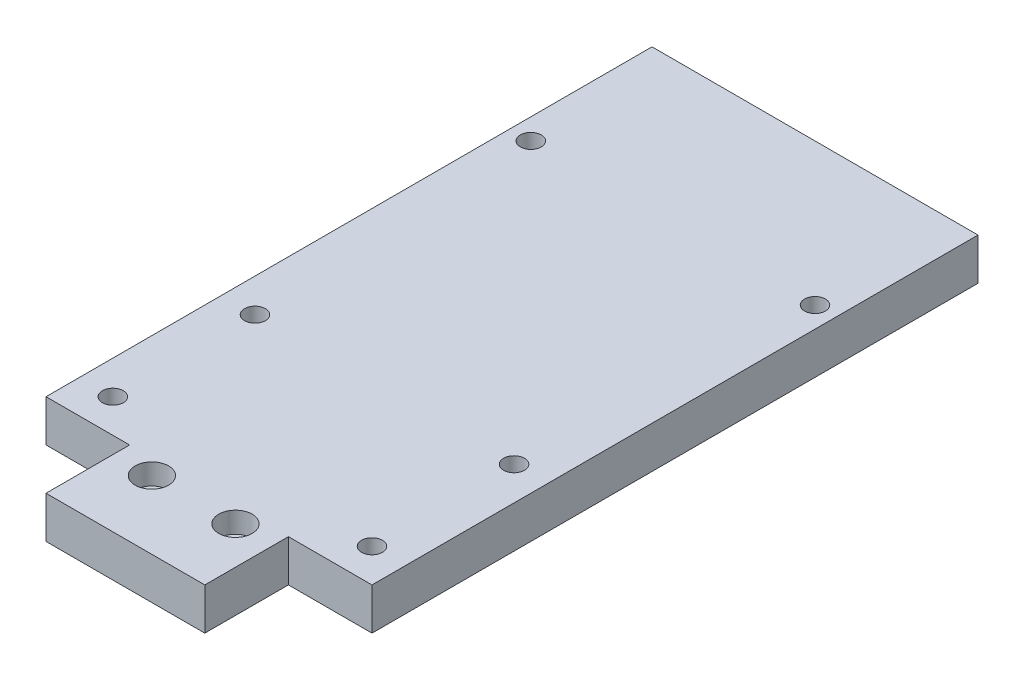
ISO-10303-21;
HEADER;
FILE_DESCRIPTION(('STEP AP214'),'2;1');
FILE_NAME('part.step','',(''),(''),'','','');
FILE_SCHEMA(('AUTOMOTIVE_DESIGN { 1 0 10303 214 1 1 1 1 }'));
ENDSEC;
DATA;
#1=APPLICATION_CONTEXT('core data for automotive mechanical design processes');
#2=APPLICATION_PROTOCOL_DEFINITION('international standard','automotive_design',2000,#1);
#3=PRODUCT_CONTEXT('',#1,'mechanical');
#4=PRODUCT('Part','Part','',(#3));
#5=PRODUCT_RELATED_PRODUCT_CATEGORY('part','',(#4));
#6=PRODUCT_DEFINITION_FORMATION('','',#4);
#7=PRODUCT_DEFINITION_CONTEXT('part definition',#1,'design');
#8=PRODUCT_DEFINITION('design','',#6,#7);
#9=PRODUCT_DEFINITION_SHAPE('','',#8);
#10=(LENGTH_UNIT() NAMED_UNIT(*) SI_UNIT(.MILLI.,.METRE.));
#11=(NAMED_UNIT(*) PLANE_ANGLE_UNIT() SI_UNIT($,.RADIAN.));
#12=(NAMED_UNIT(*) SI_UNIT($,.STERADIAN.) SOLID_ANGLE_UNIT());
#13=UNCERTAINTY_MEASURE_WITH_UNIT(LENGTH_MEASURE(1.E-05),#10,'distance_accuracy_value','');
#14=(GEOMETRIC_REPRESENTATION_CONTEXT(3) GLOBAL_UNCERTAINTY_ASSIGNED_CONTEXT((#13)) GLOBAL_UNIT_ASSIGNED_CONTEXT((#10,
#11,#12)) REPRESENTATION_CONTEXT('',''));
#15=CARTESIAN_POINT('',(0.,0.,0.));
#16=DIRECTION('',(0.,0.,1.));
#17=DIRECTION('',(1.,0.,0.));
#18=AXIS2_PLACEMENT_3D('',#15,#16,#17);
#19=CARTESIAN_POINT('',(0.,10.,-20.));
#20=DIRECTION('',(1.,0.,0.));
#21=DIRECTION('',(0.,0.,-1.));
#22=AXIS2_PLACEMENT_3D('',#19,#20,#21);
#23=PLANE('',#22);
#24=DIRECTION('',(0.,0.,1.));
#25=VECTOR('',#24,1.);
#26=CARTESIAN_POINT('',(0.,0.,-20.));
#27=LINE('',#26,#25);
#28=CARTESIAN_POINT('',(0.,0.,-20.));
#29=VERTEX_POINT('',#28);
#30=CARTESIAN_POINT('',(0.,0.,0.));
#31=VERTEX_POINT('',#30);
#32=EDGE_CURVE('E133',#29,#31,#27,.T.);
#33=ORIENTED_EDGE('',*,*,#32,.T.);
#34=DIRECTION('',(0.,-1.,0.));
#35=VECTOR('',#34,1.);
#36=CARTESIAN_POINT('',(0.,10.,0.));
#37=LINE('',#36,#35);
#38=CARTESIAN_POINT('',(0.,10.,0.));
#39=VERTEX_POINT('',#38);
#40=EDGE_CURVE('E11',#39,#31,#37,.T.);
#41=ORIENTED_EDGE('',*,*,#40,.F.);
#42=DIRECTION('',(0.,0.,1.));
#43=VECTOR('',#42,1.);
#44=CARTESIAN_POINT('',(0.,10.,-20.));
#45=LINE('',#44,#43);
#46=CARTESIAN_POINT('',(0.,10.,-20.));
#47=VERTEX_POINT('',#46);
#48=EDGE_CURVE('E148',#47,#39,#45,.T.);
#49=ORIENTED_EDGE('',*,*,#48,.F.);
#50=DIRECTION('',(0.,-1.,0.));
#51=VECTOR('',#50,1.);
#52=CARTESIAN_POINT('',(0.,10.,-20.));
#53=LINE('',#52,#51);
#54=EDGE_CURVE('E129',#47,#29,#53,.T.);
#55=ORIENTED_EDGE('',*,*,#54,.T.);
#56=EDGE_LOOP('',(#33,#41,#49,#55));
#57=FACE_BOUND('',#56,.T.);
#58=ADVANCED_FACE('F37',(#57),#23,.F.);
#59=CARTESIAN_POINT('',(0.,10.,0.));
#60=DIRECTION('',(0.,0.,-1.));
#61=DIRECTION('',(-1.,0.,0.));
#62=AXIS2_PLACEMENT_3D('',#59,#60,#61);
#63=PLANE('',#62);
#64=DIRECTION('',(1.,0.,0.));
#65=VECTOR('',#64,1.);
#66=CARTESIAN_POINT('',(0.,0.,0.));
#67=LINE('',#66,#65);
#68=CARTESIAN_POINT('',(38.,0.,0.));
#69=VERTEX_POINT('',#68);
#70=EDGE_CURVE('E136',#31,#69,#67,.T.);
#71=ORIENTED_EDGE('',*,*,#70,.T.);
#72=DIRECTION('',(0.,-1.,0.));
#73=VECTOR('',#72,1.);
#74=CARTESIAN_POINT('',(38.,10.,0.));
#75=LINE('',#74,#73);
#76=CARTESIAN_POINT('',(38.,10.,0.));
#77=VERTEX_POINT('',#76);
#78=EDGE_CURVE('E45',#77,#69,#75,.T.);
#79=ORIENTED_EDGE('',*,*,#78,.F.);
#80=DIRECTION('',(1.,0.,0.));
#81=VECTOR('',#80,1.);
#82=CARTESIAN_POINT('',(0.,10.,0.));
#83=LINE('',#82,#81);
#84=EDGE_CURVE('E96',#39,#77,#83,.T.);
#85=ORIENTED_EDGE('',*,*,#84,.F.);
#86=ORIENTED_EDGE('',*,*,#40,.T.);
#87=EDGE_LOOP('',(#71,#79,#85,#86));
#88=FACE_BOUND('',#87,.T.);
#89=ADVANCED_FACE('F334',(#88),#63,.F.);
#90=CARTESIAN_POINT('',(38.,10.,0.));
#91=DIRECTION('',(-1.,0.,0.));
#92=DIRECTION('',(0.,0.,1.));
#93=AXIS2_PLACEMENT_3D('',#90,#91,#92);
#94=PLANE('',#93);
#95=DIRECTION('',(0.,0.,-1.));
#96=VECTOR('',#95,1.);
#97=CARTESIAN_POINT('',(38.,0.,0.));
#98=LINE('',#97,#96);
#99=CARTESIAN_POINT('',(38.,0.,-20.));
#100=VERTEX_POINT('',#99);
#101=EDGE_CURVE('E139',#69,#100,#98,.T.);
#102=ORIENTED_EDGE('',*,*,#101,.T.);
#103=DIRECTION('',(0.,-1.,0.));
#104=VECTOR('',#103,1.);
#105=CARTESIAN_POINT('',(38.,10.,-20.));
#106=LINE('',#105,#104);
#107=CARTESIAN_POINT('',(38.,10.,-20.));
#108=VERTEX_POINT('',#107);
#109=EDGE_CURVE('E155',#108,#100,#106,.T.);
#110=ORIENTED_EDGE('',*,*,#109,.F.);
#111=DIRECTION('',(0.,0.,-1.));
#112=VECTOR('',#111,1.);
#113=CARTESIAN_POINT('',(38.,10.,0.));
#114=LINE('',#113,#112);
#115=EDGE_CURVE('E163',#77,#108,#114,.T.);
#116=ORIENTED_EDGE('',*,*,#115,.F.);
#117=ORIENTED_EDGE('',*,*,#78,.T.);
#118=EDGE_LOOP('',(#102,#110,#116,#117));
#119=FACE_BOUND('',#118,.T.);
#120=ADVANCED_FACE('F161',(#119),#94,.F.);
#121=CARTESIAN_POINT('',(38.,10.,-20.));
#122=DIRECTION('',(0.,0.,-1.));
#123=DIRECTION('',(-1.,0.,0.));
#124=AXIS2_PLACEMENT_3D('',#121,#122,#123);
#125=PLANE('',#124);
#126=DIRECTION('',(1.,0.,0.));
#127=VECTOR('',#126,1.);
#128=CARTESIAN_POINT('',(38.,0.,-20.));
#129=LINE('',#128,#127);
#130=CARTESIAN_POINT('',(58.,0.,-20.));
#131=VERTEX_POINT('',#130);
#132=EDGE_CURVE('E141',#100,#131,#129,.T.);
#133=ORIENTED_EDGE('',*,*,#132,.T.);
#134=DIRECTION('',(0.,-1.,0.));
#135=VECTOR('',#134,1.);
#136=CARTESIAN_POINT('',(58.,10.,-20.));
#137=LINE('',#136,#135);
#138=CARTESIAN_POINT('',(58.,10.,-20.));
#139=VERTEX_POINT('',#138);
#140=EDGE_CURVE('E152',#139,#131,#137,.T.);
#141=ORIENTED_EDGE('',*,*,#140,.F.);
#142=DIRECTION('',(1.,0.,0.));
#143=VECTOR('',#142,1.);
#144=CARTESIAN_POINT('',(38.,10.,-20.));
#145=LINE('',#144,#143);
#146=EDGE_CURVE('E175',#108,#139,#145,.T.);
#147=ORIENTED_EDGE('',*,*,#146,.F.);
#148=ORIENTED_EDGE('',*,*,#109,.T.);
#149=EDGE_LOOP('',(#133,#141,#147,#148));
#150=FACE_BOUND('',#149,.T.);
#151=ADVANCED_FACE('F171',(#150),#125,.F.);
#152=CARTESIAN_POINT('',(58.,10.,-20.));
#153=DIRECTION('',(-1.,0.,0.));
#154=DIRECTION('',(0.,0.,1.));
#155=AXIS2_PLACEMENT_3D('',#152,#153,#154);
#156=PLANE('',#155);
#157=DIRECTION('',(0.,0.,-1.));
#158=VECTOR('',#157,1.);
#159=CARTESIAN_POINT('',(58.,0.,-20.));
#160=LINE('',#159,#158);
#161=CARTESIAN_POINT('',(58.,0.,-165.));
#162=VERTEX_POINT('',#161);
#163=EDGE_CURVE('E143',#131,#162,#160,.T.);
#164=ORIENTED_EDGE('',*,*,#163,.T.);
#165=DIRECTION('',(0.,-1.,0.));
#166=VECTOR('',#165,1.);
#167=CARTESIAN_POINT('',(58.,10.,-165.));
#168=LINE('',#167,#166);
#169=CARTESIAN_POINT('',(58.,10.,-165.));
#170=VERTEX_POINT('',#169);
#171=EDGE_CURVE('E124',#170,#162,#168,.T.);
#172=ORIENTED_EDGE('',*,*,#171,.F.);
#173=DIRECTION('',(0.,0.,-1.));
#174=VECTOR('',#173,1.);
#175=CARTESIAN_POINT('',(58.,10.,-20.));
#176=LINE('',#175,#174);
#177=EDGE_CURVE('E115',#139,#170,#176,.T.);
#178=ORIENTED_EDGE('',*,*,#177,.F.);
#179=ORIENTED_EDGE('',*,*,#140,.T.);
#180=EDGE_LOOP('',(#164,#172,#178,#179));
#181=FACE_BOUND('',#180,.T.);
#182=ADVANCED_FACE('F174',(#181),#156,.F.);
#183=CARTESIAN_POINT('',(58.,10.,-165.));
#184=DIRECTION('',(0.,0.,1.));
#185=DIRECTION('',(1.,0.,0.));
#186=AXIS2_PLACEMENT_3D('',#183,#184,#185);
#187=PLANE('',#186);
#188=DIRECTION('',(-1.,0.,0.));
#189=VECTOR('',#188,1.);
#190=CARTESIAN_POINT('',(58.,0.,-165.));
#191=LINE('',#190,#189);
#192=CARTESIAN_POINT('',(-20.,0.,-165.));
#193=VERTEX_POINT('',#192);
#194=EDGE_CURVE('E123',#162,#193,#191,.T.);
#195=ORIENTED_EDGE('',*,*,#194,.T.);
#196=DIRECTION('',(0.,-1.,0.));
#197=VECTOR('',#196,1.);
#198=CARTESIAN_POINT('',(-20.,10.,-165.));
#199=LINE('',#198,#197);
#200=CARTESIAN_POINT('',(-20.,10.,-165.));
#201=VERTEX_POINT('',#200);
#202=EDGE_CURVE('E120',#201,#193,#199,.T.);
#203=ORIENTED_EDGE('',*,*,#202,.F.);
#204=DIRECTION('',(-1.,0.,0.));
#205=VECTOR('',#204,1.);
#206=CARTESIAN_POINT('',(58.,10.,-165.));
#207=LINE('',#206,#205);
#208=EDGE_CURVE('E109',#170,#201,#207,.T.);
#209=ORIENTED_EDGE('',*,*,#208,.F.);
#210=ORIENTED_EDGE('',*,*,#171,.T.);
#211=EDGE_LOOP('',(#195,#203,#209,#210));
#212=FACE_BOUND('',#211,.T.);
#213=ADVANCED_FACE('F121',(#212),#187,.F.);
#214=CARTESIAN_POINT('',(-20.,10.,-165.));
#215=DIRECTION('',(1.,0.,0.));
#216=DIRECTION('',(0.,0.,-1.));
#217=AXIS2_PLACEMENT_3D('',#214,#215,#216);
#218=PLANE('',#217);
#219=DIRECTION('',(0.,0.,1.));
#220=VECTOR('',#219,1.);
#221=CARTESIAN_POINT('',(-20.,0.,-165.));
#222=LINE('',#221,#220);
#223=CARTESIAN_POINT('',(-20.,0.,-20.));
#224=VERTEX_POINT('',#223);
#225=EDGE_CURVE('E82',#193,#224,#222,.T.);
#226=ORIENTED_EDGE('',*,*,#225,.T.);
#227=DIRECTION('',(0.,-1.,0.));
#228=VECTOR('',#227,1.);
#229=CARTESIAN_POINT('',(-20.,10.,-20.));
#230=LINE('',#229,#228);
#231=CARTESIAN_POINT('',(-20.,10.,-20.));
#232=VERTEX_POINT('',#231);
#233=EDGE_CURVE('E125',#232,#224,#230,.T.);
#234=ORIENTED_EDGE('',*,*,#233,.F.);
#235=DIRECTION('',(0.,0.,1.));
#236=VECTOR('',#235,1.);
#237=CARTESIAN_POINT('',(-20.,10.,-165.));
#238=LINE('',#237,#236);
#239=EDGE_CURVE('E113',#201,#232,#238,.T.);
#240=ORIENTED_EDGE('',*,*,#239,.F.);
#241=ORIENTED_EDGE('',*,*,#202,.T.);
#242=EDGE_LOOP('',(#226,#234,#240,#241));
#243=FACE_BOUND('',#242,.T.);
#244=ADVANCED_FACE('F127',(#243),#218,.F.);
#245=CARTESIAN_POINT('',(-20.,10.,-20.));
#246=DIRECTION('',(0.,0.,-1.));
#247=DIRECTION('',(-1.,0.,0.));
#248=AXIS2_PLACEMENT_3D('',#245,#246,#247);
#249=PLANE('',#248);
#250=DIRECTION('',(1.,0.,0.));
#251=VECTOR('',#250,1.);
#252=CARTESIAN_POINT('',(-20.,0.,-20.));
#253=LINE('',#252,#251);
#254=EDGE_CURVE('E88',#224,#29,#253,.T.);
#255=ORIENTED_EDGE('',*,*,#254,.T.);
#256=ORIENTED_EDGE('',*,*,#54,.F.);
#257=DIRECTION('',(1.,0.,0.));
#258=VECTOR('',#257,1.);
#259=CARTESIAN_POINT('',(-20.,10.,-20.));
#260=LINE('',#259,#258);
#261=EDGE_CURVE('E53',#232,#47,#260,.T.);
#262=ORIENTED_EDGE('',*,*,#261,.F.);
#263=ORIENTED_EDGE('',*,*,#233,.T.);
#264=EDGE_LOOP('',(#255,#256,#262,#263));
#265=FACE_BOUND('',#264,.T.);
#266=ADVANCED_FACE('F325',(#265),#249,.F.);
#267=CARTESIAN_POINT('',(0.,10.,0.));
#268=DIRECTION('',(0.,1.,0.));
#269=DIRECTION('',(0.,0.,1.));
#270=AXIS2_PLACEMENT_3D('',#267,#268,#269);
#271=PLANE('',#270);
#272=CARTESIAN_POINT('',(-12.,10.,-62.));
#273=DIRECTION('',(0.,-1.,0.));
#274=DIRECTION('',(0.,0.,-1.));
#275=AXIS2_PLACEMENT_3D('',#272,#273,#274);
#276=CIRCLE('',#275,2.5);
#277=CARTESIAN_POINT('',(-12.,10.,-64.5));
#278=VERTEX_POINT('',#277);
#279=EDGE_CURVE('E259',#278,#278,#276,.T.);
#280=ORIENTED_EDGE('',*,*,#279,.T.);
#281=EDGE_LOOP('',(#280));
#282=FACE_BOUND('',#281,.T.);
#283=CARTESIAN_POINT('',(50.,10.,-28.));
#284=DIRECTION('',(0.,-1.,0.));
#285=DIRECTION('',(0.,0.,-1.));
#286=AXIS2_PLACEMENT_3D('',#283,#284,#285);
#287=CIRCLE('',#286,2.5);
#288=CARTESIAN_POINT('',(50.,10.,-30.5));
#289=VERTEX_POINT('',#288);
#290=EDGE_CURVE('E266',#289,#289,#287,.T.);
#291=ORIENTED_EDGE('',*,*,#290,.T.);
#292=EDGE_LOOP('',(#291));
#293=FACE_BOUND('',#292,.T.);
#294=CARTESIAN_POINT('',(-12.,10.,-28.));
#295=DIRECTION('',(0.,-1.,0.));
#296=DIRECTION('',(0.,0.,-1.));
#297=AXIS2_PLACEMENT_3D('',#294,#295,#296);
#298=CIRCLE('',#297,2.5);
#299=CARTESIAN_POINT('',(-12.,10.,-30.5));
#300=VERTEX_POINT('',#299);
#301=EDGE_CURVE('E247',#300,#300,#298,.T.);
#302=ORIENTED_EDGE('',*,*,#301,.T.);
#303=EDGE_LOOP('',(#302));
#304=FACE_BOUND('',#303,.T.);
#305=CARTESIAN_POINT('',(53.,10.,-131.));
#306=DIRECTION('',(0.,-1.,0.));
#307=DIRECTION('',(0.,0.,-1.));
#308=AXIS2_PLACEMENT_3D('',#305,#306,#307);
#309=CIRCLE('',#308,2.5);
#310=CARTESIAN_POINT('',(53.,10.,-133.5));
#311=VERTEX_POINT('',#310);
#312=EDGE_CURVE('E254',#311,#311,#309,.T.);
#313=ORIENTED_EDGE('',*,*,#312,.T.);
#314=EDGE_LOOP('',(#313));
#315=FACE_BOUND('',#314,.T.);
#316=CARTESIAN_POINT('',(50.,10.,-62.));
#317=DIRECTION('',(0.,-1.,0.));
#318=DIRECTION('',(0.,0.,-1.));
#319=AXIS2_PLACEMENT_3D('',#316,#317,#318);
#320=CIRCLE('',#319,2.5);
#321=CARTESIAN_POINT('',(50.,10.,-64.5));
#322=VERTEX_POINT('',#321);
#323=EDGE_CURVE('E271',#322,#322,#320,.T.);
#324=ORIENTED_EDGE('',*,*,#323,.T.);
#325=EDGE_LOOP('',(#324));
#326=FACE_BOUND('',#325,.T.);
#327=CARTESIAN_POINT('',(-15.,10.,-131.));
#328=DIRECTION('',(0.,-1.,0.));
#329=DIRECTION('',(0.,0.,-1.));
#330=AXIS2_PLACEMENT_3D('',#327,#328,#329);
#331=CIRCLE('',#330,2.5);
#332=CARTESIAN_POINT('',(-15.,10.,-133.5));
#333=VERTEX_POINT('',#332);
#334=EDGE_CURVE('E238',#333,#333,#331,.T.);
#335=ORIENTED_EDGE('',*,*,#334,.T.);
#336=EDGE_LOOP('',(#335));
#337=FACE_BOUND('',#336,.T.);
#338=CARTESIAN_POINT('',(9.,10.,-16.3298675950837));
#339=DIRECTION('',(0.,1.,0.));
#340=DIRECTION('',(0.,0.,1.));
#341=AXIS2_PLACEMENT_3D('',#338,#339,#340);
#342=CIRCLE('',#341,4.);
#343=CARTESIAN_POINT('',(9.,10.,-12.3298675950837));
#344=VERTEX_POINT('',#343);
#345=EDGE_CURVE('E188',#344,#344,#342,.T.);
#346=ORIENTED_EDGE('',*,*,#345,.F.);
#347=EDGE_LOOP('',(#346));
#348=FACE_BOUND('',#347,.T.);
#349=CARTESIAN_POINT('',(29.,10.,-16.3298675950837));
#350=DIRECTION('',(0.,1.,0.));
#351=DIRECTION('',(0.,0.,1.));
#352=AXIS2_PLACEMENT_3D('',#349,#350,#351);
#353=CIRCLE('',#352,4.00000000000001);
#354=CARTESIAN_POINT('',(29.,10.,-12.3298675950837));
#355=VERTEX_POINT('',#354);
#356=EDGE_CURVE('E184',#355,#355,#353,.T.);
#357=ORIENTED_EDGE('',*,*,#356,.F.);
#358=EDGE_LOOP('',(#357));
#359=FACE_BOUND('',#358,.T.);
#360=ORIENTED_EDGE('',*,*,#48,.T.);
#361=ORIENTED_EDGE('',*,*,#84,.T.);
#362=ORIENTED_EDGE('',*,*,#115,.T.);
#363=ORIENTED_EDGE('',*,*,#146,.T.);
#364=ORIENTED_EDGE('',*,*,#177,.T.);
#365=ORIENTED_EDGE('',*,*,#208,.T.);
#366=ORIENTED_EDGE('',*,*,#239,.T.);
#367=ORIENTED_EDGE('',*,*,#261,.T.);
#368=EDGE_LOOP('',(#360,#361,#362,#363,#364,#365,#366,#367));
#369=FACE_BOUND('',#368,.T.);
#370=ADVANCED_FACE('F111',(#282,#293,#304,#315,#326,#337,#348,#359,#369),#271,.T.);
#371=CARTESIAN_POINT('',(0.,0.,0.));
#372=DIRECTION('',(0.,1.,0.));
#373=DIRECTION('',(0.,0.,1.));
#374=AXIS2_PLACEMENT_3D('',#371,#372,#373);
#375=PLANE('',#374);
#376=CARTESIAN_POINT('',(-12.,0.,-62.));
#377=DIRECTION('',(0.,-1.,0.));
#378=DIRECTION('',(0.,0.,-1.));
#379=AXIS2_PLACEMENT_3D('',#376,#377,#378);
#380=CIRCLE('',#379,4.);
#381=CARTESIAN_POINT('',(-12.,0.,-66.));
#382=VERTEX_POINT('',#381);
#383=EDGE_CURVE('E226',#382,#382,#380,.T.);
#384=ORIENTED_EDGE('',*,*,#383,.F.);
#385=EDGE_LOOP('',(#384));
#386=FACE_BOUND('',#385,.T.);
#387=CARTESIAN_POINT('',(50.,0.,-28.));
#388=DIRECTION('',(0.,-1.,0.));
#389=DIRECTION('',(0.,0.,-1.));
#390=AXIS2_PLACEMENT_3D('',#387,#388,#389);
#391=CIRCLE('',#390,4.00000000000001);
#392=CARTESIAN_POINT('',(50.,0.,-32.));
#393=VERTEX_POINT('',#392);
#394=EDGE_CURVE('E215',#393,#393,#391,.T.);
#395=ORIENTED_EDGE('',*,*,#394,.F.);
#396=EDGE_LOOP('',(#395));
#397=FACE_BOUND('',#396,.T.);
#398=CARTESIAN_POINT('',(-12.,0.,-28.));
#399=DIRECTION('',(0.,-1.,0.));
#400=DIRECTION('',(0.,0.,-1.));
#401=AXIS2_PLACEMENT_3D('',#398,#399,#400);
#402=CIRCLE('',#401,4.);
#403=CARTESIAN_POINT('',(-12.,0.,-32.));
#404=VERTEX_POINT('',#403);
#405=EDGE_CURVE('E214',#404,#404,#402,.T.);
#406=ORIENTED_EDGE('',*,*,#405,.F.);
#407=EDGE_LOOP('',(#406));
#408=FACE_BOUND('',#407,.T.);
#409=CARTESIAN_POINT('',(53.,0.,-131.));
#410=DIRECTION('',(0.,-1.,0.));
#411=DIRECTION('',(0.,0.,-1.));
#412=AXIS2_PLACEMENT_3D('',#409,#410,#411);
#413=CIRCLE('',#412,4.00000000000001);
#414=CARTESIAN_POINT('',(53.,0.,-135.));
#415=VERTEX_POINT('',#414);
#416=EDGE_CURVE('E208',#415,#415,#413,.T.);
#417=ORIENTED_EDGE('',*,*,#416,.F.);
#418=EDGE_LOOP('',(#417));
#419=FACE_BOUND('',#418,.T.);
#420=CARTESIAN_POINT('',(50.,0.,-62.));
#421=DIRECTION('',(0.,-1.,0.));
#422=DIRECTION('',(0.,0.,-1.));
#423=AXIS2_PLACEMENT_3D('',#420,#421,#422);
#424=CIRCLE('',#423,4.00000000000001);
#425=CARTESIAN_POINT('',(50.,0.,-66.));
#426=VERTEX_POINT('',#425);
#427=EDGE_CURVE('E227',#426,#426,#424,.T.);
#428=ORIENTED_EDGE('',*,*,#427,.F.);
#429=EDGE_LOOP('',(#428));
#430=FACE_BOUND('',#429,.T.);
#431=CARTESIAN_POINT('',(-15.,0.,-131.));
#432=DIRECTION('',(0.,-1.,0.));
#433=DIRECTION('',(0.,0.,-1.));
#434=AXIS2_PLACEMENT_3D('',#431,#432,#433);
#435=CIRCLE('',#434,4.);
#436=CARTESIAN_POINT('',(-15.,0.,-135.));
#437=VERTEX_POINT('',#436);
#438=EDGE_CURVE('E205',#437,#437,#435,.T.);
#439=ORIENTED_EDGE('',*,*,#438,.F.);
#440=EDGE_LOOP('',(#439));
#441=FACE_BOUND('',#440,.T.);
#442=CARTESIAN_POINT('',(9.,0.,-16.3298675950837));
#443=DIRECTION('',(0.,1.,0.));
#444=DIRECTION('',(0.,0.,1.));
#445=AXIS2_PLACEMENT_3D('',#442,#443,#444);
#446=CIRCLE('',#445,2.5);
#447=CARTESIAN_POINT('',(9.,0.,-13.8298675950837));
#448=VERTEX_POINT('',#447);
#449=EDGE_CURVE('E185',#448,#448,#446,.T.);
#450=ORIENTED_EDGE('',*,*,#449,.T.);
#451=EDGE_LOOP('',(#450));
#452=FACE_BOUND('',#451,.T.);
#453=CARTESIAN_POINT('',(29.,0.,-16.3298675950837));
#454=DIRECTION('',(0.,1.,0.));
#455=DIRECTION('',(0.,0.,1.));
#456=AXIS2_PLACEMENT_3D('',#453,#454,#455);
#457=CIRCLE('',#456,2.5);
#458=CARTESIAN_POINT('',(29.,0.,-13.8298675950837));
#459=VERTEX_POINT('',#458);
#460=EDGE_CURVE('E193',#459,#459,#457,.T.);
#461=ORIENTED_EDGE('',*,*,#460,.T.);
#462=EDGE_LOOP('',(#461));
#463=FACE_BOUND('',#462,.T.);
#464=ORIENTED_EDGE('',*,*,#32,.F.);
#465=ORIENTED_EDGE('',*,*,#254,.F.);
#466=ORIENTED_EDGE('',*,*,#225,.F.);
#467=ORIENTED_EDGE('',*,*,#194,.F.);
#468=ORIENTED_EDGE('',*,*,#163,.F.);
#469=ORIENTED_EDGE('',*,*,#132,.F.);
#470=ORIENTED_EDGE('',*,*,#101,.F.);
#471=ORIENTED_EDGE('',*,*,#70,.F.);
#472=EDGE_LOOP('',(#464,#465,#466,#467,#468,#469,#470,#471));
#473=FACE_BOUND('',#472,.T.);
#474=ADVANCED_FACE('F167',(#386,#397,#408,#419,#430,#441,#452,#463,#473),#375,.F.);
#475=CARTESIAN_POINT('',(29.,5.,-16.3298675950837));
#476=DIRECTION('',(0.,1.,0.));
#477=DIRECTION('',(0.,0.,1.));
#478=AXIS2_PLACEMENT_3D('',#475,#476,#477);
#479=CYLINDRICAL_SURFACE('',#478,4.00000000000001);
#480=CARTESIAN_POINT('',(29.,5.,-16.3298675950837));
#481=DIRECTION('',(0.,1.,0.));
#482=DIRECTION('',(0.,0.,1.));
#483=AXIS2_PLACEMENT_3D('',#480,#481,#482);
#484=CIRCLE('',#483,4.00000000000001);
#485=CARTESIAN_POINT('',(29.,5.,-12.3298675950837));
#486=VERTEX_POINT('',#485);
#487=EDGE_CURVE('E181',#486,#486,#484,.T.);
#488=ORIENTED_EDGE('',*,*,#487,.F.);
#489=EDGE_LOOP('',(#488));
#490=FACE_BOUND('',#489,.T.);
#491=ORIENTED_EDGE('',*,*,#356,.T.);
#492=EDGE_LOOP('',(#491));
#493=FACE_BOUND('',#492,.T.);
#494=ADVANCED_FACE('F295',(#490,#493),#479,.F.);
#495=CARTESIAN_POINT('',(29.,5.,-16.3298675950837));
#496=DIRECTION('',(0.,1.,0.));
#497=DIRECTION('',(0.,0.,1.));
#498=AXIS2_PLACEMENT_3D('',#495,#496,#497);
#499=PLANE('',#498);
#500=CARTESIAN_POINT('',(29.,5.,-16.3298675950837));
#501=DIRECTION('',(0.,1.,0.));
#502=DIRECTION('',(0.,0.,1.));
#503=AXIS2_PLACEMENT_3D('',#500,#501,#502);
#504=CIRCLE('',#503,2.5);
#505=CARTESIAN_POINT('',(29.,5.,-13.8298675950837));
#506=VERTEX_POINT('',#505);
#507=EDGE_CURVE('E196',#506,#506,#504,.T.);
#508=ORIENTED_EDGE('',*,*,#507,.F.);
#509=EDGE_LOOP('',(#508));
#510=FACE_BOUND('',#509,.T.);
#511=ORIENTED_EDGE('',*,*,#487,.T.);
#512=EDGE_LOOP('',(#511));
#513=FACE_BOUND('',#512,.T.);
#514=ADVANCED_FACE('F312',(#510,#513),#499,.T.);
#515=CARTESIAN_POINT('',(9.,5.,-16.3298675950837));
#516=DIRECTION('',(0.,1.,0.));
#517=DIRECTION('',(0.,0.,1.));
#518=AXIS2_PLACEMENT_3D('',#515,#516,#517);
#519=CYLINDRICAL_SURFACE('',#518,4.);
#520=CARTESIAN_POINT('',(9.,5.,-16.3298675950837));
#521=DIRECTION('',(0.,1.,0.));
#522=DIRECTION('',(0.,0.,1.));
#523=AXIS2_PLACEMENT_3D('',#520,#521,#522);
#524=CIRCLE('',#523,4.);
#525=CARTESIAN_POINT('',(9.,5.,-12.3298675950837));
#526=VERTEX_POINT('',#525);
#527=EDGE_CURVE('E137',#526,#526,#524,.T.);
#528=ORIENTED_EDGE('',*,*,#527,.F.);
#529=EDGE_LOOP('',(#528));
#530=FACE_BOUND('',#529,.T.);
#531=ORIENTED_EDGE('',*,*,#345,.T.);
#532=EDGE_LOOP('',(#531));
#533=FACE_BOUND('',#532,.T.);
#534=ADVANCED_FACE('F315',(#530,#533),#519,.F.);
#535=CARTESIAN_POINT('',(9.,5.,-16.3298675950837));
#536=DIRECTION('',(0.,1.,0.));
#537=DIRECTION('',(0.,0.,1.));
#538=AXIS2_PLACEMENT_3D('',#535,#536,#537);
#539=PLANE('',#538);
#540=CARTESIAN_POINT('',(9.,5.,-16.3298675950837));
#541=DIRECTION('',(0.,1.,0.));
#542=DIRECTION('',(0.,0.,1.));
#543=AXIS2_PLACEMENT_3D('',#540,#541,#542);
#544=CIRCLE('',#543,2.5);
#545=CARTESIAN_POINT('',(9.,5.,-13.8298675950837));
#546=VERTEX_POINT('',#545);
#547=EDGE_CURVE('E200',#546,#546,#544,.T.);
#548=ORIENTED_EDGE('',*,*,#547,.F.);
#549=EDGE_LOOP('',(#548));
#550=FACE_BOUND('',#549,.T.);
#551=ORIENTED_EDGE('',*,*,#527,.T.);
#552=EDGE_LOOP('',(#551));
#553=FACE_BOUND('',#552,.T.);
#554=ADVANCED_FACE('F308',(#550,#553),#539,.T.);
#555=CARTESIAN_POINT('',(29.,0.,-16.3298675950837));
#556=DIRECTION('',(0.,1.,0.));
#557=DIRECTION('',(0.,0.,1.));
#558=AXIS2_PLACEMENT_3D('',#555,#556,#557);
#559=CYLINDRICAL_SURFACE('',#558,2.5);
#560=ORIENTED_EDGE('',*,*,#460,.F.);
#561=EDGE_LOOP('',(#560));
#562=FACE_BOUND('',#561,.T.);
#563=ORIENTED_EDGE('',*,*,#507,.T.);
#564=EDGE_LOOP('',(#563));
#565=FACE_BOUND('',#564,.T.);
#566=ADVANCED_FACE('F304',(#562,#565),#559,.F.);
#567=CARTESIAN_POINT('',(9.,0.,-16.3298675950837));
#568=DIRECTION('',(0.,1.,0.));
#569=DIRECTION('',(0.,0.,1.));
#570=AXIS2_PLACEMENT_3D('',#567,#568,#569);
#571=CYLINDRICAL_SURFACE('',#570,2.5);
#572=ORIENTED_EDGE('',*,*,#449,.F.);
#573=EDGE_LOOP('',(#572));
#574=FACE_BOUND('',#573,.T.);
#575=ORIENTED_EDGE('',*,*,#547,.T.);
#576=EDGE_LOOP('',(#575));
#577=FACE_BOUND('',#576,.T.);
#578=ADVANCED_FACE('F307',(#574,#577),#571,.F.);
#579=CARTESIAN_POINT('',(-15.,5.,-131.));
#580=DIRECTION('',(0.,-1.,0.));
#581=DIRECTION('',(0.,0.,-1.));
#582=AXIS2_PLACEMENT_3D('',#579,#580,#581);
#583=CYLINDRICAL_SURFACE('',#582,4.);
#584=CARTESIAN_POINT('',(-15.,5.,-131.));
#585=DIRECTION('',(0.,-1.,0.));
#586=DIRECTION('',(0.,0.,-1.));
#587=AXIS2_PLACEMENT_3D('',#584,#585,#586);
#588=CIRCLE('',#587,4.);
#589=CARTESIAN_POINT('',(-15.,5.,-135.));
#590=VERTEX_POINT('',#589);
#591=EDGE_CURVE('E197',#590,#590,#588,.T.);
#592=ORIENTED_EDGE('',*,*,#591,.F.);
#593=EDGE_LOOP('',(#592));
#594=FACE_BOUND('',#593,.T.);
#595=ORIENTED_EDGE('',*,*,#438,.T.);
#596=EDGE_LOOP('',(#595));
#597=FACE_BOUND('',#596,.T.);
#598=ADVANCED_FACE('F414',(#594,#597),#583,.F.);
#599=CARTESIAN_POINT('',(-15.,5.,-131.));
#600=DIRECTION('',(0.,-1.,0.));
#601=DIRECTION('',(0.,0.,-1.));
#602=AXIS2_PLACEMENT_3D('',#599,#600,#601);
#603=PLANE('',#602);
#604=CARTESIAN_POINT('',(-15.,5.,-131.));
#605=DIRECTION('',(0.,-1.,0.));
#606=DIRECTION('',(0.,0.,-1.));
#607=AXIS2_PLACEMENT_3D('',#604,#605,#606);
#608=CIRCLE('',#607,2.5);
#609=CARTESIAN_POINT('',(-15.,5.,-133.5));
#610=VERTEX_POINT('',#609);
#611=EDGE_CURVE('E241',#610,#610,#608,.T.);
#612=ORIENTED_EDGE('',*,*,#611,.F.);
#613=EDGE_LOOP('',(#612));
#614=FACE_BOUND('',#613,.T.);
#615=ORIENTED_EDGE('',*,*,#591,.T.);
#616=EDGE_LOOP('',(#615));
#617=FACE_BOUND('',#616,.T.);
#618=ADVANCED_FACE('F289',(#614,#617),#603,.T.);
#619=CARTESIAN_POINT('',(50.,5.,-62.));
#620=DIRECTION('',(0.,-1.,0.));
#621=DIRECTION('',(0.,0.,-1.));
#622=AXIS2_PLACEMENT_3D('',#619,#620,#621);
#623=CYLINDRICAL_SURFACE('',#622,4.00000000000001);
#624=CARTESIAN_POINT('',(50.,5.,-62.));
#625=DIRECTION('',(0.,-1.,0.));
#626=DIRECTION('',(0.,0.,-1.));
#627=AXIS2_PLACEMENT_3D('',#624,#625,#626);
#628=CIRCLE('',#627,4.00000000000001);
#629=CARTESIAN_POINT('',(50.,5.,-66.));
#630=VERTEX_POINT('',#629);
#631=EDGE_CURVE('E235',#630,#630,#628,.T.);
#632=ORIENTED_EDGE('',*,*,#631,.F.);
#633=EDGE_LOOP('',(#632));
#634=FACE_BOUND('',#633,.T.);
#635=ORIENTED_EDGE('',*,*,#427,.T.);
#636=EDGE_LOOP('',(#635));
#637=FACE_BOUND('',#636,.T.);
#638=ADVANCED_FACE('F283',(#634,#637),#623,.F.);
#639=CARTESIAN_POINT('',(50.,5.,-62.));
#640=DIRECTION('',(0.,-1.,0.));
#641=DIRECTION('',(0.,0.,-1.));
#642=AXIS2_PLACEMENT_3D('',#639,#640,#641);
#643=PLANE('',#642);
#644=CARTESIAN_POINT('',(50.,5.,-62.));
#645=DIRECTION('',(0.,-1.,0.));
#646=DIRECTION('',(0.,0.,-1.));
#647=AXIS2_PLACEMENT_3D('',#644,#645,#646);
#648=CIRCLE('',#647,2.5);
#649=CARTESIAN_POINT('',(50.,5.,-64.5));
#650=VERTEX_POINT('',#649);
#651=EDGE_CURVE('E263',#650,#650,#648,.T.);
#652=ORIENTED_EDGE('',*,*,#651,.F.);
#653=EDGE_LOOP('',(#652));
#654=FACE_BOUND('',#653,.T.);
#655=ORIENTED_EDGE('',*,*,#631,.T.);
#656=EDGE_LOOP('',(#655));
#657=FACE_BOUND('',#656,.T.);
#658=ADVANCED_FACE('F279',(#654,#657),#643,.T.);
#659=CARTESIAN_POINT('',(53.,5.,-131.));
#660=DIRECTION('',(0.,-1.,0.));
#661=DIRECTION('',(0.,0.,-1.));
#662=AXIS2_PLACEMENT_3D('',#659,#660,#661);
#663=CYLINDRICAL_SURFACE('',#662,4.00000000000001);
#664=CARTESIAN_POINT('',(53.,5.,-131.));
#665=DIRECTION('',(0.,-1.,0.));
#666=DIRECTION('',(0.,0.,-1.));
#667=AXIS2_PLACEMENT_3D('',#664,#665,#666);
#668=CIRCLE('',#667,4.00000000000001);
#669=CARTESIAN_POINT('',(53.,5.,-135.));
#670=VERTEX_POINT('',#669);
#671=EDGE_CURVE('E218',#670,#670,#668,.T.);
#672=ORIENTED_EDGE('',*,*,#671,.F.);
#673=EDGE_LOOP('',(#672));
#674=FACE_BOUND('',#673,.T.);
#675=ORIENTED_EDGE('',*,*,#416,.T.);
#676=EDGE_LOOP('',(#675));
#677=FACE_BOUND('',#676,.T.);
#678=ADVANCED_FACE('F282',(#674,#677),#663,.F.);
#679=CARTESIAN_POINT('',(53.,5.,-131.));
#680=DIRECTION('',(0.,-1.,0.));
#681=DIRECTION('',(0.,0.,-1.));
#682=AXIS2_PLACEMENT_3D('',#679,#680,#681);
#683=PLANE('',#682);
#684=CARTESIAN_POINT('',(53.,5.,-131.));
#685=DIRECTION('',(0.,-1.,0.));
#686=DIRECTION('',(0.,0.,-1.));
#687=AXIS2_PLACEMENT_3D('',#684,#685,#686);
#688=CIRCLE('',#687,2.5);
#689=CARTESIAN_POINT('',(53.,5.,-133.5));
#690=VERTEX_POINT('',#689);
#691=EDGE_CURVE('E244',#690,#690,#688,.T.);
#692=ORIENTED_EDGE('',*,*,#691,.F.);
#693=EDGE_LOOP('',(#692));
#694=FACE_BOUND('',#693,.T.);
#695=ORIENTED_EDGE('',*,*,#671,.T.);
#696=EDGE_LOOP('',(#695));
#697=FACE_BOUND('',#696,.T.);
#698=ADVANCED_FACE('F451',(#694,#697),#683,.T.);
#699=CARTESIAN_POINT('',(-12.,5.,-28.));
#700=DIRECTION('',(0.,-1.,0.));
#701=DIRECTION('',(0.,0.,-1.));
#702=AXIS2_PLACEMENT_3D('',#699,#700,#701);
#703=CYLINDRICAL_SURFACE('',#702,4.);
#704=CARTESIAN_POINT('',(-12.,5.,-28.));
#705=DIRECTION('',(0.,-1.,0.));
#706=DIRECTION('',(0.,0.,-1.));
#707=AXIS2_PLACEMENT_3D('',#704,#705,#706);
#708=CIRCLE('',#707,4.);
#709=CARTESIAN_POINT('',(-12.,5.,-32.));
#710=VERTEX_POINT('',#709);
#711=EDGE_CURVE('E211',#710,#710,#708,.T.);
#712=ORIENTED_EDGE('',*,*,#711,.F.);
#713=EDGE_LOOP('',(#712));
#714=FACE_BOUND('',#713,.T.);
#715=ORIENTED_EDGE('',*,*,#405,.T.);
#716=EDGE_LOOP('',(#715));
#717=FACE_BOUND('',#716,.T.);
#718=ADVANCED_FACE('F460',(#714,#717),#703,.F.);
#719=CARTESIAN_POINT('',(-12.,5.,-28.));
#720=DIRECTION('',(0.,-1.,0.));
#721=DIRECTION('',(0.,0.,-1.));
#722=AXIS2_PLACEMENT_3D('',#719,#720,#721);
#723=PLANE('',#722);
#724=CARTESIAN_POINT('',(-12.,5.,-28.));
#725=DIRECTION('',(0.,-1.,0.));
#726=DIRECTION('',(0.,0.,-1.));
#727=AXIS2_PLACEMENT_3D('',#724,#725,#726);
#728=CIRCLE('',#727,2.5);
#729=CARTESIAN_POINT('',(-12.,5.,-30.5));
#730=VERTEX_POINT('',#729);
#731=EDGE_CURVE('E250',#730,#730,#728,.T.);
#732=ORIENTED_EDGE('',*,*,#731,.F.);
#733=EDGE_LOOP('',(#732));
#734=FACE_BOUND('',#733,.T.);
#735=ORIENTED_EDGE('',*,*,#711,.T.);
#736=EDGE_LOOP('',(#735));
#737=FACE_BOUND('',#736,.T.);
#738=ADVANCED_FACE('F465',(#734,#737),#723,.T.);
#739=CARTESIAN_POINT('',(50.,5.,-28.));
#740=DIRECTION('',(0.,-1.,0.));
#741=DIRECTION('',(0.,0.,-1.));
#742=AXIS2_PLACEMENT_3D('',#739,#740,#741);
#743=CYLINDRICAL_SURFACE('',#742,4.00000000000001);
#744=CARTESIAN_POINT('',(50.,5.,-28.));
#745=DIRECTION('',(0.,-1.,0.));
#746=DIRECTION('',(0.,0.,-1.));
#747=AXIS2_PLACEMENT_3D('',#744,#745,#746);
#748=CIRCLE('',#747,4.00000000000001);
#749=CARTESIAN_POINT('',(50.,5.,-32.));
#750=VERTEX_POINT('',#749);
#751=EDGE_CURVE('E230',#750,#750,#748,.T.);
#752=ORIENTED_EDGE('',*,*,#751,.F.);
#753=EDGE_LOOP('',(#752));
#754=FACE_BOUND('',#753,.T.);
#755=ORIENTED_EDGE('',*,*,#394,.T.);
#756=EDGE_LOOP('',(#755));
#757=FACE_BOUND('',#756,.T.);
#758=ADVANCED_FACE('F474',(#754,#757),#743,.F.);
#759=CARTESIAN_POINT('',(50.,5.,-28.));
#760=DIRECTION('',(0.,-1.,0.));
#761=DIRECTION('',(0.,0.,-1.));
#762=AXIS2_PLACEMENT_3D('',#759,#760,#761);
#763=PLANE('',#762);
#764=CARTESIAN_POINT('',(50.,5.,-28.));
#765=DIRECTION('',(0.,-1.,0.));
#766=DIRECTION('',(0.,0.,-1.));
#767=AXIS2_PLACEMENT_3D('',#764,#765,#766);
#768=CIRCLE('',#767,2.5);
#769=CARTESIAN_POINT('',(50.,5.,-30.5));
#770=VERTEX_POINT('',#769);
#771=EDGE_CURVE('E251',#770,#770,#768,.T.);
#772=ORIENTED_EDGE('',*,*,#771,.F.);
#773=EDGE_LOOP('',(#772));
#774=FACE_BOUND('',#773,.T.);
#775=ORIENTED_EDGE('',*,*,#751,.T.);
#776=EDGE_LOOP('',(#775));
#777=FACE_BOUND('',#776,.T.);
#778=ADVANCED_FACE('F479',(#774,#777),#763,.T.);
#779=CARTESIAN_POINT('',(-12.,5.,-62.));
#780=DIRECTION('',(0.,-1.,0.));
#781=DIRECTION('',(0.,0.,-1.));
#782=AXIS2_PLACEMENT_3D('',#779,#780,#781);
#783=CYLINDRICAL_SURFACE('',#782,4.);
#784=CARTESIAN_POINT('',(-12.,5.,-62.));
#785=DIRECTION('',(0.,-1.,0.));
#786=DIRECTION('',(0.,0.,-1.));
#787=AXIS2_PLACEMENT_3D('',#784,#785,#786);
#788=CIRCLE('',#787,4.);
#789=CARTESIAN_POINT('',(-12.,5.,-66.));
#790=VERTEX_POINT('',#789);
#791=EDGE_CURVE('E223',#790,#790,#788,.T.);
#792=ORIENTED_EDGE('',*,*,#791,.F.);
#793=EDGE_LOOP('',(#792));
#794=FACE_BOUND('',#793,.T.);
#795=ORIENTED_EDGE('',*,*,#383,.T.);
#796=EDGE_LOOP('',(#795));
#797=FACE_BOUND('',#796,.T.);
#798=ADVANCED_FACE('F488',(#794,#797),#783,.F.);
#799=CARTESIAN_POINT('',(-12.,5.,-62.));
#800=DIRECTION('',(0.,-1.,0.));
#801=DIRECTION('',(0.,0.,-1.));
#802=AXIS2_PLACEMENT_3D('',#799,#800,#801);
#803=PLANE('',#802);
#804=CARTESIAN_POINT('',(-12.,5.,-62.));
#805=DIRECTION('',(0.,-1.,0.));
#806=DIRECTION('',(0.,0.,-1.));
#807=AXIS2_PLACEMENT_3D('',#804,#805,#806);
#808=CIRCLE('',#807,2.5);
#809=CARTESIAN_POINT('',(-12.,5.,-64.5));
#810=VERTEX_POINT('',#809);
#811=EDGE_CURVE('E262',#810,#810,#808,.T.);
#812=ORIENTED_EDGE('',*,*,#811,.F.);
#813=EDGE_LOOP('',(#812));
#814=FACE_BOUND('',#813,.T.);
#815=ORIENTED_EDGE('',*,*,#791,.T.);
#816=EDGE_LOOP('',(#815));
#817=FACE_BOUND('',#816,.T.);
#818=ADVANCED_FACE('F492',(#814,#817),#803,.T.);
#819=CARTESIAN_POINT('',(-15.,10.,-131.));
#820=DIRECTION('',(0.,-1.,0.));
#821=DIRECTION('',(0.,0.,-1.));
#822=AXIS2_PLACEMENT_3D('',#819,#820,#821);
#823=CYLINDRICAL_SURFACE('',#822,2.5);
#824=ORIENTED_EDGE('',*,*,#334,.F.);
#825=EDGE_LOOP('',(#824));
#826=FACE_BOUND('',#825,.T.);
#827=ORIENTED_EDGE('',*,*,#611,.T.);
#828=EDGE_LOOP('',(#827));
#829=FACE_BOUND('',#828,.T.);
#830=ADVANCED_FACE('F546',(#826,#829),#823,.F.);
#831=CARTESIAN_POINT('',(50.,10.,-62.));
#832=DIRECTION('',(0.,-1.,0.));
#833=DIRECTION('',(0.,0.,-1.));
#834=AXIS2_PLACEMENT_3D('',#831,#832,#833);
#835=CYLINDRICAL_SURFACE('',#834,2.5);
#836=ORIENTED_EDGE('',*,*,#323,.F.);
#837=EDGE_LOOP('',(#836));
#838=FACE_BOUND('',#837,.T.);
#839=ORIENTED_EDGE('',*,*,#651,.T.);
#840=EDGE_LOOP('',(#839));
#841=FACE_BOUND('',#840,.T.);
#842=ADVANCED_FACE('F277',(#838,#841),#835,.F.);
#843=CARTESIAN_POINT('',(53.,10.,-131.));
#844=DIRECTION('',(0.,-1.,0.));
#845=DIRECTION('',(0.,0.,-1.));
#846=AXIS2_PLACEMENT_3D('',#843,#844,#845);
#847=CYLINDRICAL_SURFACE('',#846,2.5);
#848=ORIENTED_EDGE('',*,*,#312,.F.);
#849=EDGE_LOOP('',(#848));
#850=FACE_BOUND('',#849,.T.);
#851=ORIENTED_EDGE('',*,*,#691,.T.);
#852=EDGE_LOOP('',(#851));
#853=FACE_BOUND('',#852,.T.);
#854=ADVANCED_FACE('F567',(#850,#853),#847,.F.);
#855=CARTESIAN_POINT('',(-12.,10.,-28.));
#856=DIRECTION('',(0.,-1.,0.));
#857=DIRECTION('',(0.,0.,-1.));
#858=AXIS2_PLACEMENT_3D('',#855,#856,#857);
#859=CYLINDRICAL_SURFACE('',#858,2.5);
#860=ORIENTED_EDGE('',*,*,#301,.F.);
#861=EDGE_LOOP('',(#860));
#862=FACE_BOUND('',#861,.T.);
#863=ORIENTED_EDGE('',*,*,#731,.T.);
#864=EDGE_LOOP('',(#863));
#865=FACE_BOUND('',#864,.T.);
#866=ADVANCED_FACE('F578',(#862,#865),#859,.F.);
#867=CARTESIAN_POINT('',(50.,10.,-28.));
#868=DIRECTION('',(0.,-1.,0.));
#869=DIRECTION('',(0.,0.,-1.));
#870=AXIS2_PLACEMENT_3D('',#867,#868,#869);
#871=CYLINDRICAL_SURFACE('',#870,2.5);
#872=ORIENTED_EDGE('',*,*,#290,.F.);
#873=EDGE_LOOP('',(#872));
#874=FACE_BOUND('',#873,.T.);
#875=ORIENTED_EDGE('',*,*,#771,.T.);
#876=EDGE_LOOP('',(#875));
#877=FACE_BOUND('',#876,.T.);
#878=ADVANCED_FACE('F589',(#874,#877),#871,.F.);
#879=CARTESIAN_POINT('',(-12.,10.,-62.));
#880=DIRECTION('',(0.,-1.,0.));
#881=DIRECTION('',(0.,0.,-1.));
#882=AXIS2_PLACEMENT_3D('',#879,#880,#881);
#883=CYLINDRICAL_SURFACE('',#882,2.5);
#884=ORIENTED_EDGE('',*,*,#279,.F.);
#885=EDGE_LOOP('',(#884));
#886=FACE_BOUND('',#885,.T.);
#887=ORIENTED_EDGE('',*,*,#811,.T.);
#888=EDGE_LOOP('',(#887));
#889=FACE_BOUND('',#888,.T.);
#890=ADVANCED_FACE('F600',(#886,#889),#883,.F.);
#891=CLOSED_SHELL('',(#58,#89,#120,#151,#182,#213,#244,#266,#370,#474,#494,#514,#534,#554,#566,
#578,#598,#618,#638,#658,#678,#698,#718,#738,#758,#778,#798,#818,#830,#842,#854,#866,#878,#890));
#892=MANIFOLD_SOLID_BREP('B2',#891);
#893=ADVANCED_BREP_SHAPE_REPRESENTATION('',(#18,#892),#14);
#894=SHAPE_DEFINITION_REPRESENTATION(#9,#893);
ENDSEC;
END-ISO-10303-21;
